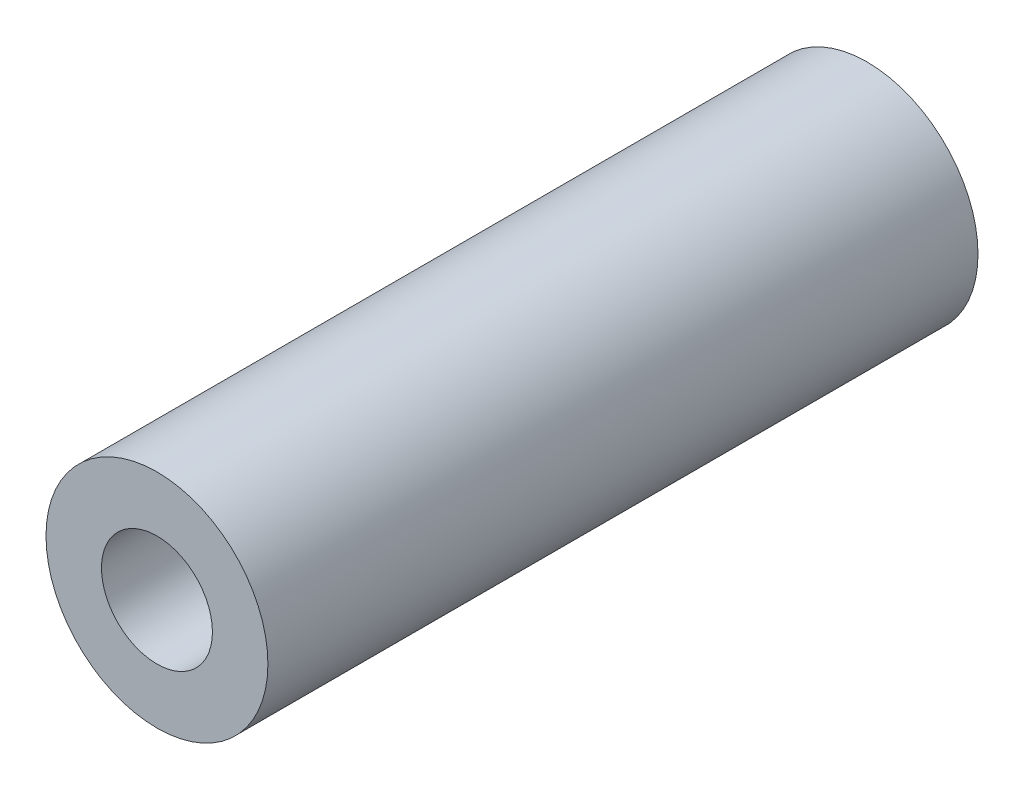
ISO-10303-21;
HEADER;
FILE_DESCRIPTION(('STEP AP214'),'2;1');
FILE_NAME('part.step','',(''),(''),'','','');
FILE_SCHEMA(('AUTOMOTIVE_DESIGN { 1 0 10303 214 1 1 1 1 }'));
ENDSEC;
DATA;
#1=APPLICATION_CONTEXT('core data for automotive mechanical design processes');
#2=APPLICATION_PROTOCOL_DEFINITION('international standard','automotive_design',2000,#1);
#3=PRODUCT_CONTEXT('',#1,'mechanical');
#4=PRODUCT('Part','Part','',(#3));
#5=PRODUCT_RELATED_PRODUCT_CATEGORY('part','',(#4));
#6=PRODUCT_DEFINITION_FORMATION('','',#4);
#7=PRODUCT_DEFINITION_CONTEXT('part definition',#1,'design');
#8=PRODUCT_DEFINITION('design','',#6,#7);
#9=PRODUCT_DEFINITION_SHAPE('','',#8);
#10=(LENGTH_UNIT() NAMED_UNIT(*) SI_UNIT(.MILLI.,.METRE.));
#11=(NAMED_UNIT(*) PLANE_ANGLE_UNIT() SI_UNIT($,.RADIAN.));
#12=(NAMED_UNIT(*) SI_UNIT($,.STERADIAN.) SOLID_ANGLE_UNIT());
#13=UNCERTAINTY_MEASURE_WITH_UNIT(LENGTH_MEASURE(1.E-05),#10,'distance_accuracy_value','');
#14=(GEOMETRIC_REPRESENTATION_CONTEXT(3) GLOBAL_UNCERTAINTY_ASSIGNED_CONTEXT((#13)) GLOBAL_UNIT_ASSIGNED_CONTEXT((#10,
#11,#12)) REPRESENTATION_CONTEXT('',''));
#15=CARTESIAN_POINT('',(0.,0.,0.));
#16=DIRECTION('',(0.,0.,1.));
#17=DIRECTION('',(1.,0.,0.));
#18=AXIS2_PLACEMENT_3D('',#15,#16,#17);
#19=CARTESIAN_POINT('',(0.,0.,16.));
#20=DIRECTION('',(0.,0.,1.));
#21=DIRECTION('',(1.,0.,0.));
#22=AXIS2_PLACEMENT_3D('',#19,#20,#21);
#23=PLANE('',#22);
#24=CARTESIAN_POINT('',(0.,0.,16.));
#25=DIRECTION('',(0.,0.,1.));
#26=DIRECTION('',(1.,0.,0.));
#27=AXIS2_PLACEMENT_3D('',#24,#25,#26);
#28=CIRCLE('',#27,2.5);
#29=CARTESIAN_POINT('',(2.5,0.,16.));
#30=VERTEX_POINT('',#29);
#31=EDGE_CURVE('E10',#30,#30,#28,.T.);
#32=ORIENTED_EDGE('',*,*,#31,.T.);
#33=EDGE_LOOP('',(#32));
#34=FACE_BOUND('',#33,.T.);
#35=CARTESIAN_POINT('',(0.,0.,16.));
#36=DIRECTION('',(0.,0.,1.));
#37=DIRECTION('',(1.,0.,0.));
#38=AXIS2_PLACEMENT_3D('',#35,#36,#37);
#39=CIRCLE('',#38,1.25);
#40=CARTESIAN_POINT('',(1.25,0.,16.));
#41=VERTEX_POINT('',#40);
#42=EDGE_CURVE('E42',#41,#41,#39,.T.);
#43=ORIENTED_EDGE('',*,*,#42,.F.);
#44=EDGE_LOOP('',(#43));
#45=FACE_BOUND('',#44,.T.);
#46=ADVANCED_FACE('F31',(#34,#45),#23,.T.);
#47=CARTESIAN_POINT('',(0.,0.,0.));
#48=DIRECTION('',(0.,0.,1.));
#49=DIRECTION('',(1.,0.,0.));
#50=AXIS2_PLACEMENT_3D('',#47,#48,#49);
#51=PLANE('',#50);
#52=CARTESIAN_POINT('',(0.,0.,0.));
#53=DIRECTION('',(0.,0.,1.));
#54=DIRECTION('',(1.,0.,0.));
#55=AXIS2_PLACEMENT_3D('',#52,#53,#54);
#56=CIRCLE('',#55,2.5);
#57=CARTESIAN_POINT('',(2.5,0.,0.));
#58=VERTEX_POINT('',#57);
#59=EDGE_CURVE('E35',#58,#58,#56,.T.);
#60=ORIENTED_EDGE('',*,*,#59,.F.);
#61=EDGE_LOOP('',(#60));
#62=FACE_BOUND('',#61,.T.);
#63=CARTESIAN_POINT('',(0.,0.,0.));
#64=DIRECTION('',(0.,0.,1.));
#65=DIRECTION('',(1.,0.,0.));
#66=AXIS2_PLACEMENT_3D('',#63,#64,#65);
#67=CIRCLE('',#66,1.25);
#68=CARTESIAN_POINT('',(1.25,0.,0.));
#69=VERTEX_POINT('',#68);
#70=EDGE_CURVE('E44',#69,#69,#67,.T.);
#71=ORIENTED_EDGE('',*,*,#70,.T.);
#72=EDGE_LOOP('',(#71));
#73=FACE_BOUND('',#72,.T.);
#74=ADVANCED_FACE('F54',(#62,#73),#51,.F.);
#75=CARTESIAN_POINT('',(0.,0.,16.));
#76=DIRECTION('',(0.,0.,-1.));
#77=DIRECTION('',(-1.,0.,0.));
#78=AXIS2_PLACEMENT_3D('',#75,#76,#77);
#79=CYLINDRICAL_SURFACE('',#78,2.5);
#80=ORIENTED_EDGE('',*,*,#31,.F.);
#81=EDGE_LOOP('',(#80));
#82=FACE_BOUND('',#81,.T.);
#83=ORIENTED_EDGE('',*,*,#59,.T.);
#84=EDGE_LOOP('',(#83));
#85=FACE_BOUND('',#84,.T.);
#86=ADVANCED_FACE('F33',(#82,#85),#79,.T.);
#87=CARTESIAN_POINT('',(0.,0.,16.));
#88=DIRECTION('',(0.,0.,-1.));
#89=DIRECTION('',(-1.,0.,0.));
#90=AXIS2_PLACEMENT_3D('',#87,#88,#89);
#91=CYLINDRICAL_SURFACE('',#90,1.25);
#92=ORIENTED_EDGE('',*,*,#42,.T.);
#93=EDGE_LOOP('',(#92));
#94=FACE_BOUND('',#93,.T.);
#95=ORIENTED_EDGE('',*,*,#70,.F.);
#96=EDGE_LOOP('',(#95));
#97=FACE_BOUND('',#96,.T.);
#98=ADVANCED_FACE('F50',(#94,#97),#91,.F.);
#99=CLOSED_SHELL('',(#46,#74,#86,#98));
#100=MANIFOLD_SOLID_BREP('B2',#99);
#101=ADVANCED_BREP_SHAPE_REPRESENTATION('',(#18,#100),#14);
#102=SHAPE_DEFINITION_REPRESENTATION(#9,#101);
ENDSEC;
END-ISO-10303-21;
